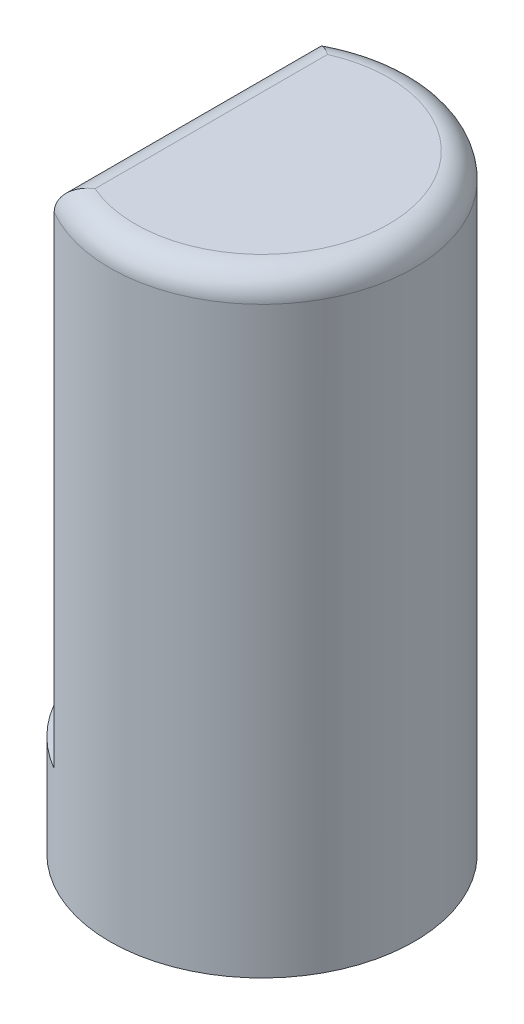
ISO-10303-21;
HEADER;
FILE_DESCRIPTION(('STEP AP214'),'2;1');
FILE_NAME('part.step','',(''),(''),'','','');
FILE_SCHEMA(('AUTOMOTIVE_DESIGN { 1 0 10303 214 1 1 1 1 }'));
ENDSEC;
DATA;
#1=APPLICATION_CONTEXT('core data for automotive mechanical design processes');
#2=APPLICATION_PROTOCOL_DEFINITION('international standard','automotive_design',2000,#1);
#3=PRODUCT_CONTEXT('',#1,'mechanical');
#4=PRODUCT('Part','Part','',(#3));
#5=PRODUCT_RELATED_PRODUCT_CATEGORY('part','',(#4));
#6=PRODUCT_DEFINITION_FORMATION('','',#4);
#7=PRODUCT_DEFINITION_CONTEXT('part definition',#1,'design');
#8=PRODUCT_DEFINITION('design','',#6,#7);
#9=PRODUCT_DEFINITION_SHAPE('','',#8);
#10=(LENGTH_UNIT() NAMED_UNIT(*) SI_UNIT(.MILLI.,.METRE.));
#11=(NAMED_UNIT(*) PLANE_ANGLE_UNIT() SI_UNIT($,.RADIAN.));
#12=(NAMED_UNIT(*) SI_UNIT($,.STERADIAN.) SOLID_ANGLE_UNIT());
#13=UNCERTAINTY_MEASURE_WITH_UNIT(LENGTH_MEASURE(1.E-05),#10,'distance_accuracy_value','');
#14=(GEOMETRIC_REPRESENTATION_CONTEXT(3) GLOBAL_UNCERTAINTY_ASSIGNED_CONTEXT((#13)) GLOBAL_UNIT_ASSIGNED_CONTEXT((#10,
#11,#12)) REPRESENTATION_CONTEXT('',''));
#15=CARTESIAN_POINT('',(0.,0.,0.));
#16=DIRECTION('',(0.,0.,1.));
#17=DIRECTION('',(1.,0.,0.));
#18=AXIS2_PLACEMENT_3D('',#15,#16,#17);
#19=CARTESIAN_POINT('',(0.,12.,0.));
#20=DIRECTION('',(0.,-1.,0.));
#21=DIRECTION('',(0.,0.,-1.));
#22=AXIS2_PLACEMENT_3D('',#19,#20,#21);
#23=CYLINDRICAL_SURFACE('',#22,3.);
#24=DIRECTION('',(0.,1.,0.));
#25=VECTOR('',#24,1.);
#26=CARTESIAN_POINT('',(-1.5,2.,-2.59807621135332));
#27=LINE('',#26,#25);
#28=CARTESIAN_POINT('',(-1.5,2.,-2.59807621135332));
#29=VERTEX_POINT('',#28);
#30=CARTESIAN_POINT('',(-1.5,11.5,-2.59807621135332));
#31=VERTEX_POINT('',#30);
#32=EDGE_CURVE('E84',#29,#31,#27,.T.);
#33=ORIENTED_EDGE('',*,*,#32,.T.);
#34=CARTESIAN_POINT('',(0.,11.5,0.));
#35=DIRECTION('',(0.,1.,0.));
#36=DIRECTION('',(0.,0.,1.));
#37=AXIS2_PLACEMENT_3D('',#34,#35,#36);
#38=CIRCLE('',#37,3.);
#39=CARTESIAN_POINT('',(-1.5,11.5,2.59807621135332));
#40=VERTEX_POINT('',#39);
#41=EDGE_CURVE('E46',#31,#40,#38,.F.);
#42=ORIENTED_EDGE('',*,*,#41,.T.);
#43=DIRECTION('',(0.,1.,0.));
#44=VECTOR('',#43,1.);
#45=CARTESIAN_POINT('',(-1.5,2.,2.59807621135332));
#46=LINE('',#45,#44);
#47=CARTESIAN_POINT('',(-1.5,2.,2.59807621135332));
#48=VERTEX_POINT('',#47);
#49=EDGE_CURVE('E83',#48,#40,#46,.T.);
#50=ORIENTED_EDGE('',*,*,#49,.F.);
#51=CARTESIAN_POINT('',(0.,2.,0.));
#52=DIRECTION('',(0.,1.,0.));
#53=DIRECTION('',(0.,0.,1.));
#54=AXIS2_PLACEMENT_3D('',#51,#52,#53);
#55=CIRCLE('',#54,3.);
#56=EDGE_CURVE('E73',#29,#48,#55,.T.);
#57=ORIENTED_EDGE('',*,*,#56,.F.);
#58=EDGE_LOOP('',(#33,#42,#50,#57));
#59=FACE_BOUND('',#58,.T.);
#60=CARTESIAN_POINT('',(0.,0.,0.));
#61=DIRECTION('',(0.,1.,0.));
#62=DIRECTION('',(0.,0.,1.));
#63=AXIS2_PLACEMENT_3D('',#60,#61,#62);
#64=CIRCLE('',#63,3.);
#65=CARTESIAN_POINT('',(0.,0.,3.));
#66=VERTEX_POINT('',#65);
#67=EDGE_CURVE('E80',#66,#66,#64,.T.);
#68=ORIENTED_EDGE('',*,*,#67,.T.);
#69=EDGE_LOOP('',(#68));
#70=FACE_BOUND('',#69,.T.);
#71=ADVANCED_FACE('F32',(#59,#70),#23,.T.);
#72=CARTESIAN_POINT('',(0.,12.,0.));
#73=DIRECTION('',(0.,1.,0.));
#74=DIRECTION('',(0.,0.,1.));
#75=AXIS2_PLACEMENT_3D('',#72,#73,#74);
#76=PLANE('',#75);
#77=DIRECTION('',(0.,0.,-1.));
#78=VECTOR('',#77,1.);
#79=CARTESIAN_POINT('',(-1.,12.,2.59807621135332));
#80=LINE('',#79,#78);
#81=CARTESIAN_POINT('',(-1.,12.,-2.29128784747792));
#82=VERTEX_POINT('',#81);
#83=CARTESIAN_POINT('',(-1.,12.,2.29128784747792));
#84=VERTEX_POINT('',#83);
#85=EDGE_CURVE('E79',#82,#84,#80,.F.);
#86=ORIENTED_EDGE('',*,*,#85,.T.);
#87=CARTESIAN_POINT('',(0.,12.,0.));
#88=DIRECTION('',(0.,1.,0.));
#89=DIRECTION('',(0.,0.,1.));
#90=AXIS2_PLACEMENT_3D('',#87,#88,#89);
#91=CIRCLE('',#90,2.5);
#92=EDGE_CURVE('E94',#84,#82,#91,.T.);
#93=ORIENTED_EDGE('',*,*,#92,.T.);
#94=EDGE_LOOP('',(#86,#93));
#95=FACE_BOUND('',#94,.T.);
#96=ADVANCED_FACE('F109',(#95),#76,.T.);
#97=CARTESIAN_POINT('',(0.,0.,0.));
#98=DIRECTION('',(0.,1.,0.));
#99=DIRECTION('',(0.,0.,1.));
#100=AXIS2_PLACEMENT_3D('',#97,#98,#99);
#101=PLANE('',#100);
#102=ORIENTED_EDGE('',*,*,#67,.F.);
#103=EDGE_LOOP('',(#102));
#104=FACE_BOUND('',#103,.T.);
#105=ADVANCED_FACE('F110',(#104),#101,.F.);
#106=CARTESIAN_POINT('',(0.,2.,0.));
#107=DIRECTION('',(0.,1.,0.));
#108=DIRECTION('',(0.,0.,1.));
#109=AXIS2_PLACEMENT_3D('',#106,#107,#108);
#110=PLANE('',#109);
#111=ORIENTED_EDGE('',*,*,#56,.T.);
#112=DIRECTION('',(0.,0.,-1.));
#113=VECTOR('',#112,1.);
#114=CARTESIAN_POINT('',(-1.5,2.,-2.59807621135332));
#115=LINE('',#114,#113);
#116=EDGE_CURVE('E76',#48,#29,#115,.T.);
#117=ORIENTED_EDGE('',*,*,#116,.T.);
#118=EDGE_LOOP('',(#111,#117));
#119=FACE_BOUND('',#118,.T.);
#120=ADVANCED_FACE('F75',(#119),#110,.T.);
#121=CARTESIAN_POINT('',(-1.5,2.,-2.59807621135332));
#122=DIRECTION('',(1.,0.,0.));
#123=DIRECTION('',(0.,0.,-1.));
#124=AXIS2_PLACEMENT_3D('',#121,#122,#123);
#125=PLANE('',#124);
#126=ORIENTED_EDGE('',*,*,#49,.T.);
#127=DIRECTION('',(0.,0.,-1.));
#128=VECTOR('',#127,1.);
#129=CARTESIAN_POINT('',(-1.5,11.5,-2.59807621135332));
#130=LINE('',#129,#128);
#131=EDGE_CURVE('E11',#40,#31,#130,.T.);
#132=ORIENTED_EDGE('',*,*,#131,.T.);
#133=ORIENTED_EDGE('',*,*,#32,.F.);
#134=ORIENTED_EDGE('',*,*,#116,.F.);
#135=EDGE_LOOP('',(#126,#132,#133,#134));
#136=FACE_BOUND('',#135,.T.);
#137=ADVANCED_FACE('F82',(#136),#125,.F.);
#138=CARTESIAN_POINT('',(-1.,11.5,-2.59807621135332));
#139=DIRECTION('',(0.,0.,1.));
#140=DIRECTION('',(1.,0.,0.));
#141=AXIS2_PLACEMENT_3D('',#138,#139,#140);
#142=CYLINDRICAL_SURFACE('',#141,0.5);
#143=CARTESIAN_POINT('',(-1.5,11.5,-2.59807621135332));
#144=CARTESIAN_POINT('',(-1.50003326618062,11.5253731475,-2.59809268421919));
#145=CARTESIAN_POINT('',(-1.49807096301462,11.5507194012911,-2.59696247258866));
#146=CARTESIAN_POINT('',(-1.49042212119804,11.6005469495308,-2.59254217379653));
#147=CARTESIAN_POINT('',(-1.48475092733416,11.6250313716941,-2.58926098573291));
#148=CARTESIAN_POINT('',(-1.46995284269544,11.6725265345493,-2.58067350340865));
#149=CARTESIAN_POINT('',(-1.46082854275531,11.6955383650176,-2.57536872740431));
#150=CARTESIAN_POINT('',(-1.43954109086368,11.7395875053733,-2.56294011984339));
#151=CARTESIAN_POINT('',(-1.4273756589688,11.7606233174834,-2.55581492342486));
#152=CARTESIAN_POINT('',(-1.39983445030962,11.8012706115963,-2.53960073916206));
#153=CARTESIAN_POINT('',(-1.38433244657543,11.8207649899382,-2.53043380579425));
#154=CARTESIAN_POINT('',(-1.35107390909329,11.8568613763748,-2.51064129127018));
#155=CARTESIAN_POINT('',(-1.33331684297346,11.8734626992784,-2.50001536562888));
#156=CARTESIAN_POINT('',(-1.29372782004047,11.9055264105468,-2.47615483770229));
#157=CARTESIAN_POINT('',(-1.27166423533527,11.9205831143018,-2.46276022210667));
#158=CARTESIAN_POINT('',(-1.22600011283718,11.9467865869761,-2.43478876587478));
#159=CARTESIAN_POINT('',(-1.20239789295028,11.9579289886748,-2.42021062694672));
#160=CARTESIAN_POINT('',(-1.15000164727367,11.9779317366078,-2.38753355560944));
#161=CARTESIAN_POINT('',(-1.12102641473886,11.9860424173748,-2.36926728531982));
#162=CARTESIAN_POINT('',(-1.06262291599552,11.9969494077742,-2.33199807473768));
#163=CARTESIAN_POINT('',(-1.03319559749081,11.9997556194573,-2.31299657475678));
#164=CARTESIAN_POINT('',(-1.00260571698262,11.999994914667,-2.29299321743259));
#165=CARTESIAN_POINT('',(-1.00130270179615,12.0000000062886,-2.29214067025097));
#166=CARTESIAN_POINT('',(-1.,12.,-2.29128784747792));
#167=B_SPLINE_CURVE_WITH_KNOTS('',3,(#143,#144,#145,#146,#147,#148,#149,#150,#151,#152,#153,
#154,#155,#156,#157,#158,#159,#160,#161,#162,#163,#164,#165,#166),.UNSPECIFIED.,.F.,.F.,(4,2,2,
2,2,2,2,2,2,2,2,4),(0.,0.075976406627034,0.151640448021558,0.227247831547838,0.302912068989415,
0.382214103990697,0.461534895426231,0.550829467873642,0.640223352976029,0.745391976343325,
0.850364082883816,0.855035487805963),.UNSPECIFIED.);
#168=EDGE_CURVE('E97',#31,#82,#167,.T.);
#169=ORIENTED_EDGE('',*,*,#168,.F.);
#170=ORIENTED_EDGE('',*,*,#131,.F.);
#171=CARTESIAN_POINT('',(-1.5,11.5,2.59807621135332));
#172=CARTESIAN_POINT('',(-1.50003326618062,11.5253731475,2.59809268421919));
#173=CARTESIAN_POINT('',(-1.49807096301462,11.5507194012911,2.59696247258866));
#174=CARTESIAN_POINT('',(-1.49042212119804,11.6005469495308,2.59254217379653));
#175=CARTESIAN_POINT('',(-1.48475092733416,11.6250313716941,2.58926098573291));
#176=CARTESIAN_POINT('',(-1.46995284269544,11.6725265345493,2.58067350340865));
#177=CARTESIAN_POINT('',(-1.46082854275531,11.6955383650176,2.57536872740431));
#178=CARTESIAN_POINT('',(-1.43954109086368,11.7395875053733,2.56294011984339));
#179=CARTESIAN_POINT('',(-1.4273756589688,11.7606233174834,2.55581492342486));
#180=CARTESIAN_POINT('',(-1.39983445030962,11.8012706115963,2.53960073916206));
#181=CARTESIAN_POINT('',(-1.38433244657543,11.8207649899382,2.53043380579425));
#182=CARTESIAN_POINT('',(-1.35107390909329,11.8568613763748,2.51064129127018));
#183=CARTESIAN_POINT('',(-1.33331684297346,11.8734626992784,2.50001536562888));
#184=CARTESIAN_POINT('',(-1.29372782004047,11.9055264105468,2.47615483770229));
#185=CARTESIAN_POINT('',(-1.27166423533527,11.9205831143018,2.46276022210667));
#186=CARTESIAN_POINT('',(-1.22600011283718,11.9467865869761,2.43478876587478));
#187=CARTESIAN_POINT('',(-1.20239789295028,11.9579289886748,2.42021062694672));
#188=CARTESIAN_POINT('',(-1.15000164727367,11.9779317366078,2.38753355560944));
#189=CARTESIAN_POINT('',(-1.12102641473886,11.9860424173748,2.36926728531982));
#190=CARTESIAN_POINT('',(-1.06262291599552,11.9969494077742,2.33199807473768));
#191=CARTESIAN_POINT('',(-1.03319559749081,11.9997556194573,2.31299657475678));
#192=CARTESIAN_POINT('',(-1.00260571698262,11.999994914667,2.29299321743259));
#193=CARTESIAN_POINT('',(-1.00130270179615,12.0000000062886,2.29214067025097));
#194=CARTESIAN_POINT('',(-1.,12.,2.29128784747792));
#195=B_SPLINE_CURVE_WITH_KNOTS('',3,(#171,#172,#173,#174,#175,#176,#177,#178,#179,#180,#181,
#182,#183,#184,#185,#186,#187,#188,#189,#190,#191,#192,#193,#194),.UNSPECIFIED.,.F.,.F.,(4,2,2,
2,2,2,2,2,2,2,2,4),(0.,0.075976406627034,0.151640448021558,0.227247831547838,0.302912068989415,
0.382214103990697,0.461534895426231,0.550829467873642,0.640223352976029,0.745391976343325,
0.850364082883816,0.855035487805963),.UNSPECIFIED.);
#196=EDGE_CURVE('E37',#84,#40,#195,.F.);
#197=ORIENTED_EDGE('',*,*,#196,.F.);
#198=ORIENTED_EDGE('',*,*,#85,.F.);
#199=EDGE_LOOP('',(#169,#170,#197,#198));
#200=FACE_BOUND('',#199,.T.);
#201=ADVANCED_FACE('F34',(#200),#142,.T.);
#202=CARTESIAN_POINT('',(0.,11.5,0.));
#203=DIRECTION('',(0.,1.,0.));
#204=DIRECTION('',(0.,0.,1.));
#205=AXIS2_PLACEMENT_3D('',#202,#203,#204);
#206=TOROIDAL_SURFACE('',#205,2.5,0.5);
#207=ORIENTED_EDGE('',*,*,#196,.T.);
#208=ORIENTED_EDGE('',*,*,#41,.F.);
#209=ORIENTED_EDGE('',*,*,#168,.T.);
#210=ORIENTED_EDGE('',*,*,#92,.F.);
#211=EDGE_LOOP('',(#207,#208,#209,#210));
#212=FACE_BOUND('',#211,.T.);
#213=ADVANCED_FACE('F102',(#212),#206,.T.);
#214=CLOSED_SHELL('',(#71,#96,#105,#120,#137,#201,#213));
#215=MANIFOLD_SOLID_BREP('B2',#214);
#216=ADVANCED_BREP_SHAPE_REPRESENTATION('',(#18,#215),#14);
#217=SHAPE_DEFINITION_REPRESENTATION(#9,#216);
ENDSEC;
END-ISO-10303-21;
